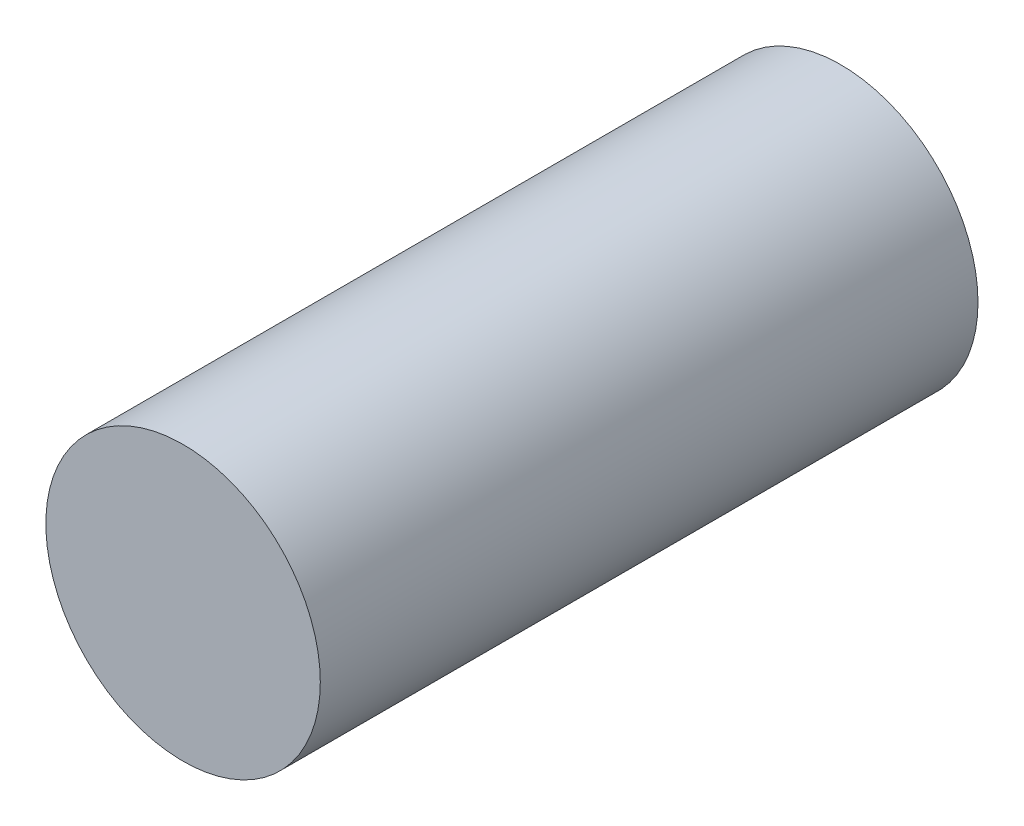
ISO-10303-21;
HEADER;
FILE_DESCRIPTION(('STEP AP214'),'2;1');
FILE_NAME('part.step','',(''),(''),'','','');
FILE_SCHEMA(('AUTOMOTIVE_DESIGN { 1 0 10303 214 1 1 1 1 }'));
ENDSEC;
DATA;
#1=APPLICATION_CONTEXT('core data for automotive mechanical design processes');
#2=APPLICATION_PROTOCOL_DEFINITION('international standard','automotive_design',2000,#1);
#3=PRODUCT_CONTEXT('',#1,'mechanical');
#4=PRODUCT('Part','Part','',(#3));
#5=PRODUCT_RELATED_PRODUCT_CATEGORY('part','',(#4));
#6=PRODUCT_DEFINITION_FORMATION('','',#4);
#7=PRODUCT_DEFINITION_CONTEXT('part definition',#1,'design');
#8=PRODUCT_DEFINITION('design','',#6,#7);
#9=PRODUCT_DEFINITION_SHAPE('','',#8);
#10=(LENGTH_UNIT() NAMED_UNIT(*) SI_UNIT(.MILLI.,.METRE.));
#11=(NAMED_UNIT(*) PLANE_ANGLE_UNIT() SI_UNIT($,.RADIAN.));
#12=(NAMED_UNIT(*) SI_UNIT($,.STERADIAN.) SOLID_ANGLE_UNIT());
#13=UNCERTAINTY_MEASURE_WITH_UNIT(LENGTH_MEASURE(1.E-05),#10,'distance_accuracy_value','');
#14=(GEOMETRIC_REPRESENTATION_CONTEXT(3) GLOBAL_UNCERTAINTY_ASSIGNED_CONTEXT((#13)) GLOBAL_UNIT_ASSIGNED_CONTEXT((#10,
#11,#12)) REPRESENTATION_CONTEXT('',''));
#15=CARTESIAN_POINT('',(0.,0.,0.));
#16=DIRECTION('',(0.,0.,1.));
#17=DIRECTION('',(1.,0.,0.));
#18=AXIS2_PLACEMENT_3D('',#15,#16,#17);
#19=CARTESIAN_POINT('',(0.,0.,76.2));
#20=DIRECTION('',(0.,0.,-1.));
#21=DIRECTION('',(-1.,0.,0.));
#22=AXIS2_PLACEMENT_3D('',#19,#20,#21);
#23=CYLINDRICAL_SURFACE('',#22,15.9);
#24=CARTESIAN_POINT('',(0.,0.,76.2));
#25=DIRECTION('',(0.,0.,1.));
#26=DIRECTION('',(1.,0.,0.));
#27=AXIS2_PLACEMENT_3D('',#24,#25,#26);
#28=CIRCLE('',#27,15.9);
#29=CARTESIAN_POINT('',(15.9,0.,76.2));
#30=VERTEX_POINT('',#29);
#31=EDGE_CURVE('E10',#30,#30,#28,.T.);
#32=ORIENTED_EDGE('',*,*,#31,.F.);
#33=EDGE_LOOP('',(#32));
#34=FACE_BOUND('',#33,.T.);
#35=CARTESIAN_POINT('',(0.,0.,0.));
#36=DIRECTION('',(0.,0.,1.));
#37=DIRECTION('',(1.,0.,0.));
#38=AXIS2_PLACEMENT_3D('',#35,#36,#37);
#39=CIRCLE('',#38,15.9);
#40=CARTESIAN_POINT('',(15.9,0.,0.));
#41=VERTEX_POINT('',#40);
#42=EDGE_CURVE('E32',#41,#41,#39,.T.);
#43=ORIENTED_EDGE('',*,*,#42,.T.);
#44=EDGE_LOOP('',(#43));
#45=FACE_BOUND('',#44,.T.);
#46=ADVANCED_FACE('F29',(#34,#45),#23,.T.);
#47=CARTESIAN_POINT('',(0.,0.,76.2));
#48=DIRECTION('',(0.,0.,1.));
#49=DIRECTION('',(1.,0.,0.));
#50=AXIS2_PLACEMENT_3D('',#47,#48,#49);
#51=PLANE('',#50);
#52=ORIENTED_EDGE('',*,*,#31,.T.);
#53=EDGE_LOOP('',(#52));
#54=FACE_BOUND('',#53,.T.);
#55=ADVANCED_FACE('F44',(#54),#51,.T.);
#56=CARTESIAN_POINT('',(0.,0.,0.));
#57=DIRECTION('',(0.,0.,1.));
#58=DIRECTION('',(1.,0.,0.));
#59=AXIS2_PLACEMENT_3D('',#56,#57,#58);
#60=PLANE('',#59);
#61=ORIENTED_EDGE('',*,*,#42,.F.);
#62=EDGE_LOOP('',(#61));
#63=FACE_BOUND('',#62,.T.);
#64=ADVANCED_FACE('F42',(#63),#60,.F.);
#65=CLOSED_SHELL('',(#46,#55,#64));
#66=MANIFOLD_SOLID_BREP('B2',#65);
#67=ADVANCED_BREP_SHAPE_REPRESENTATION('',(#18,#66),#14);
#68=SHAPE_DEFINITION_REPRESENTATION(#9,#67);
ENDSEC;
END-ISO-10303-21;
